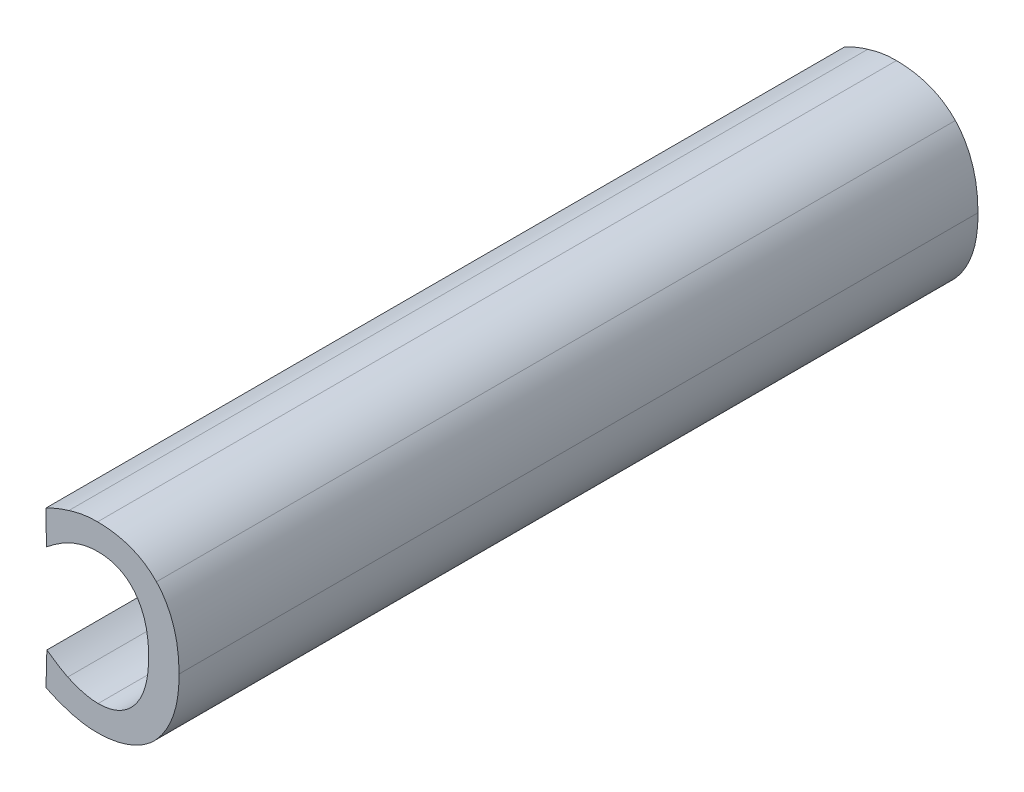
ISO-10303-21;
HEADER;
FILE_DESCRIPTION(('STEP AP214'),'2;1');
FILE_NAME('part.step','',(''),(''),'','','');
FILE_SCHEMA(('AUTOMOTIVE_DESIGN { 1 0 10303 214 1 1 1 1 }'));
ENDSEC;
DATA;
#1=APPLICATION_CONTEXT('core data for automotive mechanical design processes');
#2=APPLICATION_PROTOCOL_DEFINITION('international standard','automotive_design',2000,#1);
#3=PRODUCT_CONTEXT('',#1,'mechanical');
#4=PRODUCT('Part','Part','',(#3));
#5=PRODUCT_RELATED_PRODUCT_CATEGORY('part','',(#4));
#6=PRODUCT_DEFINITION_FORMATION('','',#4);
#7=PRODUCT_DEFINITION_CONTEXT('part definition',#1,'design');
#8=PRODUCT_DEFINITION('design','',#6,#7);
#9=PRODUCT_DEFINITION_SHAPE('','',#8);
#10=(LENGTH_UNIT() NAMED_UNIT(*) SI_UNIT(.MILLI.,.METRE.));
#11=(NAMED_UNIT(*) PLANE_ANGLE_UNIT() SI_UNIT($,.RADIAN.));
#12=(NAMED_UNIT(*) SI_UNIT($,.STERADIAN.) SOLID_ANGLE_UNIT());
#13=UNCERTAINTY_MEASURE_WITH_UNIT(LENGTH_MEASURE(1.E-05),#10,'distance_accuracy_value','');
#14=(GEOMETRIC_REPRESENTATION_CONTEXT(3) GLOBAL_UNCERTAINTY_ASSIGNED_CONTEXT((#13)) GLOBAL_UNIT_ASSIGNED_CONTEXT((#10,
#11,#12)) REPRESENTATION_CONTEXT('',''));
#15=CARTESIAN_POINT('',(0.,0.,0.));
#16=DIRECTION('',(0.,0.,1.));
#17=DIRECTION('',(1.,0.,0.));
#18=AXIS2_PLACEMENT_3D('',#15,#16,#17);
#19=CARTESIAN_POINT('',(5.06824131282,3.557182086195,0.));
#20=CARTESIAN_POINT('',(5.06824131282,3.557182086195,0.1));
#21=CARTESIAN_POINT('',(5.067366985334,3.557631065174,0.));
#22=CARTESIAN_POINT('',(5.067366985334,3.557631065174,0.1));
#23=CARTESIAN_POINT('',(5.066138200759,3.558481762187,0.));
#24=CARTESIAN_POINT('',(5.066138200759,3.558481762187,0.1));
#25=CARTESIAN_POINT('',(5.065736482725,3.558812588803,0.));
#26=CARTESIAN_POINT('',(5.065736482725,3.558812588803,0.1));
#27=CARTESIAN_POINT('',(5.06558209667783,3.55893973025352,0.));
#28=CARTESIAN_POINT('',(5.06558209667783,3.55893973025352,0.1));
#29=CARTESIAN_POINT('',(5.06542771063066,3.55906687170404,0.));
#30=CARTESIAN_POINT('',(5.06542771063066,3.55906687170404,0.1));
#31=B_SPLINE_SURFACE_WITH_KNOTS('',2,1,((#19,#20),(#21,#22),(#23,#24),(#25,#26),(#27,#28),(#29,
#30)),.UNSPECIFIED.,.F.,.F.,.F.,(3,1,2,3),(2,2),(-2.,-1.,0.,0.3843144546698),(0.,0.01),.UNSPECIFIED.);
#32=CARTESIAN_POINT('',(5.06824131282,3.557182086195,0.1));
#33=CARTESIAN_POINT('',(5.06780043462121,3.55740398369807,0.1));
#34=CARTESIAN_POINT('',(5.06737421617499,3.55764837154961,0.1));
#35=CARTESIAN_POINT('',(5.06651550629512,3.55820520815789,0.1));
#36=CARTESIAN_POINT('',(5.0660856601189,3.55852171515238,0.1));
#37=CARTESIAN_POINT('',(5.06567311895268,3.55886477073311,0.1));
#38=B_SPLINE_CURVE_WITH_KNOTS('',3,(#32,#33,#34,#35,#36,#37),.UNSPECIFIED.,.F.,.F.,(4,2,4),(0.,
0.00147393631916353,0.0030753418627236),.UNSPECIFIED.);
#39=CARTESIAN_POINT('',(5.06824131282,3.557182086195,0.1));
#40=VERTEX_POINT('',#39);
#41=CARTESIAN_POINT('',(5.0656301455985,3.558812588803,0.1));
#42=VERTEX_POINT('',#41);
#43=EDGE_CURVE('E296',#40,#42,#38,.T.);
#44=DIRECTION('',(0.,0.,1.));
#45=VECTOR('',#44,1.);
#46=CARTESIAN_POINT('',(5.06824131282,3.557182086195,0.05));
#47=LINE('',#46,#45);
#48=CARTESIAN_POINT('',(5.06824131282,3.557182086195,0.));
#49=VERTEX_POINT('',#48);
#50=EDGE_CURVE('E299',#49,#40,#47,.T.);
#51=CARTESIAN_POINT('',(5.06824131282,3.557182086195,0.));
#52=CARTESIAN_POINT('',(5.06789120548477,3.55735820568304,0.));
#53=CARTESIAN_POINT('',(5.06755021010831,3.55754865346355,0.));
#54=CARTESIAN_POINT('',(5.06667921381394,3.55808606868598,0.));
#55=CARTESIAN_POINT('',(5.06616414456795,3.55845651575151,0.));
#56=CARTESIAN_POINT('',(5.06567311895268,3.55886477073311,0.));
#57=B_SPLINE_CURVE_WITH_KNOTS('',3,(#51,#52,#53,#54,#55,#56),.UNSPECIFIED.,.F.,.F.,(4,2,4),(0.,
0.00117172259293521,0.00307507390276876),.UNSPECIFIED.);
#58=CARTESIAN_POINT('',(5.0656301455985,3.558812588803,0.));
#59=VERTEX_POINT('',#58);
#60=EDGE_CURVE('E112',#49,#59,#57,.T.);
#61=DIRECTION('',(0.,0.,1.));
#62=VECTOR('',#61,1.);
#63=CARTESIAN_POINT('',(5.065523808472,3.55898773230535,0.1));
#64=LINE('',#63,#62);
#65=EDGE_CURVE('E310',#42,#59,#64,.F.);
#66=ORIENTED_EDGE('',*,*,#43,.F.);
#67=ORIENTED_EDGE('',*,*,#50,.F.);
#68=ORIENTED_EDGE('',*,*,#60,.T.);
#69=ORIENTED_EDGE('',*,*,#65,.F.);
#70=EDGE_LOOP('',(#66,#67,#68,#69));
#71=FACE_BOUND('',#70,.T.);
#72=ADVANCED_FACE('F17',(#71),#31,.T.);
#73=CARTESIAN_POINT('',(5.065523808472,3.558812588803,0.));
#74=DIRECTION('',(-1.,0.,0.));
#75=DIRECTION('',(0.,0.,1.));
#76=AXIS2_PLACEMENT_3D('',#73,#74,#75);
#77=PLANE('',#76);
#78=DIRECTION('',(0.,-1.,0.));
#79=VECTOR('',#78,1.);
#80=CARTESIAN_POINT('',(5.065523808472,3.564459808101,0.1));
#81=LINE('',#80,#79);
#82=CARTESIAN_POINT('',(5.065523808472,3.5546772561,0.1));
#83=VERTEX_POINT('',#82);
#84=EDGE_CURVE('E298',#42,#83,#81,.T.);
#85=ORIENTED_EDGE('',*,*,#84,.F.);
#86=ORIENTED_EDGE('',*,*,#65,.T.);
#87=DIRECTION('',(0.,1.,0.));
#88=VECTOR('',#87,1.);
#89=CARTESIAN_POINT('',(5.065523808472,3.558812588803,0.));
#90=LINE('',#89,#88);
#91=CARTESIAN_POINT('',(5.065523808472,3.5546772561,0.));
#92=VERTEX_POINT('',#91);
#93=EDGE_CURVE('E151',#59,#92,#90,.F.);
#94=ORIENTED_EDGE('',*,*,#93,.T.);
#95=DIRECTION('',(0.,0.,-1.));
#96=VECTOR('',#95,1.);
#97=CARTESIAN_POINT('',(5.065523808472,3.5546772561,0.05));
#98=LINE('',#97,#96);
#99=EDGE_CURVE('E305',#83,#92,#98,.T.);
#100=ORIENTED_EDGE('',*,*,#99,.F.);
#101=EDGE_LOOP('',(#85,#86,#94,#100));
#102=FACE_BOUND('',#101,.T.);
#103=ADVANCED_FACE('F472',(#102),#77,.T.);
#104=CARTESIAN_POINT('',(5.065523808472,3.5546772561,0.));
#105=CARTESIAN_POINT('',(5.065523808472,3.5546772561,0.1));
#106=CARTESIAN_POINT('',(5.066823484465,3.554015602867,0.));
#107=CARTESIAN_POINT('',(5.066823484465,3.554015602867,0.1));
#108=CARTESIAN_POINT('',(5.070179011572,3.552999492546,0.));
#109=CARTESIAN_POINT('',(5.070179011572,3.552999492546,0.1));
#110=CARTESIAN_POINT('',(5.071974927489,3.552999492546,0.));
#111=CARTESIAN_POINT('',(5.071974927489,3.552999492546,0.1));
#112=B_SPLINE_SURFACE_WITH_KNOTS('',2,1,((#104,#105),(#106,#107),(#108,#109),(#110,#111)),
.UNSPECIFIED.,.F.,.F.,.F.,(3,1,3),(2,2),(-2.,-1.,0.),(0.,0.01),.UNSPECIFIED.);
#113=CARTESIAN_POINT('',(5.065523808472,3.5546772561,0.1));
#114=CARTESIAN_POINT('',(5.06606217268396,3.55441788380417,0.1));
#115=CARTESIAN_POINT('',(5.06661051495785,3.55417406817985,0.1));
#116=CARTESIAN_POINT('',(5.06772788318569,3.55374078208094,0.1));
#117=CARTESIAN_POINT('',(5.0682969088555,3.55355131086005,0.1));
#118=CARTESIAN_POINT('',(5.06945637927102,3.55324993876996,0.1));
#119=CARTESIAN_POINT('',(5.07004682376147,3.55313803697664,0.1));
#120=CARTESIAN_POINT('',(5.07108451179727,3.55302154495165,0.1));
#121=CARTESIAN_POINT('',(5.07152959494888,3.5529967776093,0.1));
#122=CARTESIAN_POINT('',(5.071974927489,3.552999492546,0.1));
#123=B_SPLINE_CURVE_WITH_KNOTS('',3,(#113,#114,#115,#116,#117,#118,#119,#120,#121,#122),
.UNSPECIFIED.,.F.,.F.,(4,2,2,2,4),(0.,0.00179596258772347,0.00359190051140843,
0.0053878170390403,0.00672257808529129),.UNSPECIFIED.);
#124=CARTESIAN_POINT('',(5.071974927489,3.552999492546,0.1));
#125=VERTEX_POINT('',#124);
#126=EDGE_CURVE('E276',#83,#125,#123,.T.);
#127=CARTESIAN_POINT('',(5.065523808472,3.5546772561,0.));
#128=CARTESIAN_POINT('',(5.06606217268396,3.55441788380417,0.));
#129=CARTESIAN_POINT('',(5.06661051495785,3.55417406817985,0.));
#130=CARTESIAN_POINT('',(5.06772788318569,3.55374078208094,0.));
#131=CARTESIAN_POINT('',(5.0682969088555,3.55355131086005,0.));
#132=CARTESIAN_POINT('',(5.06945637927102,3.55324993876996,0.));
#133=CARTESIAN_POINT('',(5.07004682376147,3.55313803697664,0.));
#134=CARTESIAN_POINT('',(5.07108451179727,3.55302154495165,0.));
#135=CARTESIAN_POINT('',(5.07152959494888,3.5529967776093,0.));
#136=CARTESIAN_POINT('',(5.071974927489,3.552999492546,0.));
#137=B_SPLINE_CURVE_WITH_KNOTS('',3,(#127,#128,#129,#130,#131,#132,#133,#134,#135,#136),
.UNSPECIFIED.,.F.,.F.,(4,2,2,2,4),(0.,0.00179596258772347,0.00359190051140843,
0.00538781703904115,0.00672257808529127),.UNSPECIFIED.);
#138=CARTESIAN_POINT('',(5.071974927489,3.552999492546,0.));
#139=VERTEX_POINT('',#138);
#140=EDGE_CURVE('E516',#92,#139,#137,.T.);
#141=DIRECTION('',(0.,0.,-1.));
#142=VECTOR('',#141,1.);
#143=CARTESIAN_POINT('',(5.071974927489,3.552999492546,0.05));
#144=LINE('',#143,#142);
#145=EDGE_CURVE('E309',#125,#139,#144,.T.);
#146=ORIENTED_EDGE('',*,*,#126,.F.);
#147=ORIENTED_EDGE('',*,*,#99,.T.);
#148=ORIENTED_EDGE('',*,*,#140,.T.);
#149=ORIENTED_EDGE('',*,*,#145,.F.);
#150=EDGE_LOOP('',(#146,#147,#148,#149));
#151=FACE_BOUND('',#150,.T.);
#152=ADVANCED_FACE('F463',(#151),#112,.T.);
#153=CARTESIAN_POINT('',(5.071974927489,3.552999492546,0.));
#154=CARTESIAN_POINT('',(5.071974927489,3.552999492546,0.1));
#155=CARTESIAN_POINT('',(5.074196191913,3.552999492546,0.));
#156=CARTESIAN_POINT('',(5.074196191913,3.552999492546,0.1));
#157=CARTESIAN_POINT('',(5.078047958945,3.554535473264,0.));
#158=CARTESIAN_POINT('',(5.078047958945,3.554535473264,0.1));
#159=CARTESIAN_POINT('',(5.079347634938,3.555976932092,0.));
#160=CARTESIAN_POINT('',(5.079347634938,3.555976932092,0.1));
#161=B_SPLINE_SURFACE_WITH_KNOTS('',2,1,((#153,#154),(#155,#156),(#157,#158),(#159,#160)),
.UNSPECIFIED.,.F.,.F.,.F.,(3,1,3),(2,2),(-2.,-1.,0.),(0.,0.01),.UNSPECIFIED.);
#162=CARTESIAN_POINT('',(5.071974927489,3.552999492546,0.1));
#163=CARTESIAN_POINT('',(5.07265669164065,3.55299818155809,0.0999999999999999));
#164=CARTESIAN_POINT('',(5.07333902325395,3.55305401451906,0.1));
#165=CARTESIAN_POINT('',(5.07434478438879,3.5532297996063,0.1));
#166=CARTESIAN_POINT('',(5.0746766846069,3.55330358680294,0.1));
#167=CARTESIAN_POINT('',(5.07533196034996,3.55348281331395,0.1));
#168=CARTESIAN_POINT('',(5.07565533522938,3.55358825501776,0.1));
#169=CARTESIAN_POINT('',(5.07629032157653,3.55383032352675,0.1));
#170=CARTESIAN_POINT('',(5.07660193126521,3.55396695502641,0.1));
#171=CARTESIAN_POINT('',(5.07720820408093,3.5542742836458,0.1));
#172=CARTESIAN_POINT('',(5.07750286169827,3.55444499176133,0.1));
#173=CARTESIAN_POINT('',(5.07807077821904,3.55482169799583,0.1));
#174=CARTESIAN_POINT('',(5.07834393101328,3.55502785684873,0.1));
#175=CARTESIAN_POINT('',(5.07886654439065,3.55547613716735,0.1));
#176=CARTESIAN_POINT('',(5.07911555689705,3.55571878041964,0.1));
#177=CARTESIAN_POINT('',(5.07934763492655,3.55597693207931,0.1));
#178=B_SPLINE_CURVE_WITH_KNOTS('',3,(#162,#163,#164,#165,#166,#167,#168,#169,#170,#171,#172,
#173,#174,#175,#176,#177),.UNSPECIFIED.,.F.,.F.,(4,2,2,2,2,2,2,4),(0.,0.00204239067197012,
0.00306108269162819,0.004079851626666,0.00509877400138055,0.00611802569397581,
0.00714202678322715,0.00818238265408445),.UNSPECIFIED.);
#179=CARTESIAN_POINT('',(5.079347634938,3.555976932092,0.1));
#180=VERTEX_POINT('',#179);
#181=EDGE_CURVE('E268',#125,#180,#178,.T.);
#182=CARTESIAN_POINT('',(5.071974927489,3.552999492546,0.));
#183=CARTESIAN_POINT('',(5.07265669164065,3.55299818155809,0.));
#184=CARTESIAN_POINT('',(5.07333902325395,3.55305401451906,0.));
#185=CARTESIAN_POINT('',(5.07434478438879,3.5532297996063,0.));
#186=CARTESIAN_POINT('',(5.0746766846069,3.55330358680294,0.));
#187=CARTESIAN_POINT('',(5.07533196034996,3.55348281331395,0.));
#188=CARTESIAN_POINT('',(5.07565533522938,3.55358825501776,0.));
#189=CARTESIAN_POINT('',(5.07629032157653,3.55383032352675,0.));
#190=CARTESIAN_POINT('',(5.07660193126521,3.55396695502641,0.));
#191=CARTESIAN_POINT('',(5.07720820408093,3.5542742836458,0.));
#192=CARTESIAN_POINT('',(5.07750286169827,3.55444499176133,0.));
#193=CARTESIAN_POINT('',(5.07807077821904,3.55482169799583,0.));
#194=CARTESIAN_POINT('',(5.07834393101328,3.55502785684873,0.));
#195=CARTESIAN_POINT('',(5.07886654439065,3.55547613716735,0.));
#196=CARTESIAN_POINT('',(5.07911555689705,3.55571878041964,0.));
#197=CARTESIAN_POINT('',(5.07934763492655,3.55597693207931,0.));
#198=B_SPLINE_CURVE_WITH_KNOTS('',3,(#182,#183,#184,#185,#186,#187,#188,#189,#190,#191,#192,
#193,#194,#195,#196,#197),.UNSPECIFIED.,.F.,.F.,(4,2,2,2,2,2,2,4),(0.,0.00204239067197012,
0.00306108269162819,0.004079851626666,0.00509877400138055,0.00611802569397581,
0.00714202678322715,0.00818238265408445),.UNSPECIFIED.);
#199=CARTESIAN_POINT('',(5.07934763493819,3.55597693209181,0.));
#200=VERTEX_POINT('',#199);
#201=EDGE_CURVE('E523',#139,#200,#198,.T.);
#202=DIRECTION('',(0.,0.,-1.));
#203=VECTOR('',#202,1.);
#204=CARTESIAN_POINT('',(5.079347634938,3.555976932092,0.05));
#205=LINE('',#204,#203);
#206=EDGE_CURVE('E313',#180,#200,#205,.T.);
#207=ORIENTED_EDGE('',*,*,#181,.F.);
#208=ORIENTED_EDGE('',*,*,#145,.T.);
#209=ORIENTED_EDGE('',*,*,#201,.T.);
#210=ORIENTED_EDGE('',*,*,#206,.F.);
#211=EDGE_LOOP('',(#207,#208,#209,#210));
#212=FACE_BOUND('',#211,.T.);
#213=ADVANCED_FACE('F454',(#212),#161,.T.);
#214=CARTESIAN_POINT('',(5.079347634938,3.555976932092,0.));
#215=CARTESIAN_POINT('',(5.079347634938,3.555976932092,0.1));
#216=CARTESIAN_POINT('',(5.08064731093,3.557394760448,0.));
#217=CARTESIAN_POINT('',(5.08064731093,3.557394760448,0.1));
#218=CARTESIAN_POINT('',(5.082183291649,3.561600984569,0.));
#219=CARTESIAN_POINT('',(5.082183291649,3.561600984569,0.1));
#220=CARTESIAN_POINT('',(5.082183291649,3.564483902225,0.));
#221=CARTESIAN_POINT('',(5.082183291649,3.564483902225,0.1));
#222=B_SPLINE_SURFACE_WITH_KNOTS('',2,1,((#214,#215),(#216,#217),(#218,#219),(#220,#221)),
.UNSPECIFIED.,.F.,.F.,.F.,(3,1,3),(2,2),(-2.,-1.,0.),(0.,0.01),.UNSPECIFIED.);
#223=CARTESIAN_POINT('',(5.079347634938,3.555976932092,0.1));
#224=CARTESIAN_POINT('',(5.07959212533499,3.55624349858091,0.1));
#225=CARTESIAN_POINT('',(5.07981936774911,3.55652521532284,0.1));
#226=CARTESIAN_POINT('',(5.0802400912057,3.55711277624557,0.1));
#227=CARTESIAN_POINT('',(5.08043358332241,3.55741861246423,0.1));
#228=CARTESIAN_POINT('',(5.0807876400347,3.55804831504722,0.1));
#229=CARTESIAN_POINT('',(5.08094821584625,3.55837217522205,0.1));
#230=CARTESIAN_POINT('',(5.08124154874952,3.55903216187993,0.1));
#231=CARTESIAN_POINT('',(5.08137431337673,3.55936828501125,0.1));
#232=CARTESIAN_POINT('',(5.08160610822409,3.56005216071821,0.1));
#233=CARTESIAN_POINT('',(5.08170512903172,3.56039991650902,0.1));
#234=CARTESIAN_POINT('',(5.08193244776284,3.56135660403018,0.1));
#235=CARTESIAN_POINT('',(5.08203015338335,3.56197258687727,0.1));
#236=CARTESIAN_POINT('',(5.08215551786839,3.56322135047994,0.1));
#237=CARTESIAN_POINT('',(5.08218211466357,3.56385424483962,0.1));
#238=CARTESIAN_POINT('',(5.082183291649,3.564483902225,0.1));
#239=B_SPLINE_CURVE_WITH_KNOTS('',3,(#223,#224,#225,#226,#227,#228,#229,#230,#231,#232,#233,
#234,#235,#236,#237,#238),.UNSPECIFIED.,.F.,.F.,(4,2,2,2,2,2,2,4),(0.,0.00108372170876831,
0.00216708715238745,0.00325008283182401,0.0043327846906132,0.0054157883120633,
0.00728179033563121,0.00917551089850671),.UNSPECIFIED.);
#240=CARTESIAN_POINT('',(5.082183291649,3.564483902225,0.1));
#241=VERTEX_POINT('',#240);
#242=EDGE_CURVE('E260',#180,#241,#239,.T.);
#243=CARTESIAN_POINT('',(5.079347634938,3.555976932092,0.));
#244=CARTESIAN_POINT('',(5.07959212533499,3.55624349858091,0.));
#245=CARTESIAN_POINT('',(5.07981936774911,3.55652521532284,0.));
#246=CARTESIAN_POINT('',(5.0802400912057,3.55711277624557,0.));
#247=CARTESIAN_POINT('',(5.08043358332241,3.55741861246423,0.));
#248=CARTESIAN_POINT('',(5.0807876400347,3.55804831504722,0.));
#249=CARTESIAN_POINT('',(5.08094821584625,3.55837217522205,0.));
#250=CARTESIAN_POINT('',(5.08124154874952,3.55903216187993,0.));
#251=CARTESIAN_POINT('',(5.08137431337673,3.55936828501125,0.));
#252=CARTESIAN_POINT('',(5.08160610822409,3.56005216071821,0.));
#253=CARTESIAN_POINT('',(5.08170512903172,3.56039991650902,0.));
#254=CARTESIAN_POINT('',(5.08193244776284,3.56135660403018,0.));
#255=CARTESIAN_POINT('',(5.08203015338335,3.56197258687727,0.));
#256=CARTESIAN_POINT('',(5.08215551786839,3.56322135047994,0.));
#257=CARTESIAN_POINT('',(5.08218211466357,3.56385424483962,0.));
#258=CARTESIAN_POINT('',(5.082183291649,3.564483902225,0.));
#259=B_SPLINE_CURVE_WITH_KNOTS('',3,(#243,#244,#245,#246,#247,#248,#249,#250,#251,#252,#253,
#254,#255,#256,#257,#258),.UNSPECIFIED.,.F.,.F.,(4,2,2,2,2,2,2,4),(0.,0.00108372170876831,
0.00216708715238745,0.00325008283182401,0.0043327846906132,0.0054157883120633,
0.00728179033563121,0.00917551089850671),.UNSPECIFIED.);
#260=CARTESIAN_POINT('',(5.082183291649,3.564483902225,0.));
#261=VERTEX_POINT('',#260);
#262=EDGE_CURVE('E539',#200,#261,#259,.T.);
#263=DIRECTION('',(0.,0.,-1.));
#264=VECTOR('',#263,1.);
#265=CARTESIAN_POINT('',(5.082183291649,3.564483902225,0.05));
#266=LINE('',#265,#264);
#267=EDGE_CURVE('E316',#241,#261,#266,.T.);
#268=ORIENTED_EDGE('',*,*,#242,.F.);
#269=ORIENTED_EDGE('',*,*,#206,.T.);
#270=ORIENTED_EDGE('',*,*,#262,.T.);
#271=ORIENTED_EDGE('',*,*,#267,.F.);
#272=EDGE_LOOP('',(#268,#269,#270,#271));
#273=FACE_BOUND('',#272,.T.);
#274=ADVANCED_FACE('F445',(#273),#222,.T.);
#275=CARTESIAN_POINT('',(5.082183291649,3.564483902225,0.));
#276=CARTESIAN_POINT('',(5.082183291649,3.564483902225,0.1));
#277=CARTESIAN_POINT('',(5.082183291649,3.567366819881,0.));
#278=CARTESIAN_POINT('',(5.082183291649,3.567366819881,0.1));
#279=CARTESIAN_POINT('',(5.080694571876,3.571667565893,0.));
#280=CARTESIAN_POINT('',(5.080694571876,3.571667565893,0.1));
#281=CARTESIAN_POINT('',(5.079347634938,3.573061763776,0.));
#282=CARTESIAN_POINT('',(5.079347634938,3.573061763776,0.1));
#283=B_SPLINE_SURFACE_WITH_KNOTS('',2,1,((#275,#276),(#277,#278),(#279,#280),(#281,#282)),
.UNSPECIFIED.,.F.,.F.,.F.,(3,1,3),(2,2),(-2.,-1.,0.),(0.,0.01),.UNSPECIFIED.);
#284=CARTESIAN_POINT('',(5.082183291649,3.564483902225,0.1));
#285=CARTESIAN_POINT('',(5.08218288226581,3.56518534481603,0.1));
#286=CARTESIAN_POINT('',(5.08215044917242,3.56588827789938,0.1));
#287=CARTESIAN_POINT('',(5.0820357563586,3.56693457580601,0.1));
#288=CARTESIAN_POINT('',(5.08198655125141,3.56728185353979,0.1));
#289=CARTESIAN_POINT('',(5.08186314077906,3.56797219998152,0.1));
#290=CARTESIAN_POINT('',(5.08178893062074,3.56831526786941,0.1));
#291=CARTESIAN_POINT('',(5.08161091763839,3.56899379418749,0.1));
#292=CARTESIAN_POINT('',(5.08150710750665,3.56932925071647,0.1));
#293=CARTESIAN_POINT('',(5.08127032670399,3.56998973257966,0.1));
#294=CARTESIAN_POINT('',(5.0811373556022,3.57031475775966,0.1));
#295=CARTESIAN_POINT('',(5.0808400028036,3.5709505109916,0.1));
#296=CARTESIAN_POINT('',(5.08067561017381,3.57126123402032,0.1));
#297=CARTESIAN_POINT('',(5.08016897462221,3.57210068494363,0.0999999999999999));
#298=CARTESIAN_POINT('',(5.07978915821397,3.57260661568784,0.0999999999999999));
#299=CARTESIAN_POINT('',(5.07934763493822,3.57306176377577,0.1));
#300=B_SPLINE_CURVE_WITH_KNOTS('',3,(#284,#285,#286,#287,#288,#289,#290,#291,#292,#293,#294,
#295,#296,#297,#298,#299),.UNSPECIFIED.,.F.,.F.,(4,2,2,2,2,2,2,4),(0.,0.00210493527299103,
0.00315655793463321,0.00420838229365346,0.00526046655445852,0.00631256636138775,
0.00736503291069561,0.00925316565929955),.UNSPECIFIED.);
#301=CARTESIAN_POINT('',(5.079347634938,3.573061763776,0.1));
#302=VERTEX_POINT('',#301);
#303=EDGE_CURVE('E252',#241,#302,#300,.T.);
#304=CARTESIAN_POINT('',(5.082183291649,3.564483902225,0.));
#305=CARTESIAN_POINT('',(5.08218288226581,3.56518534481603,0.));
#306=CARTESIAN_POINT('',(5.08215044917242,3.56588827789938,0.));
#307=CARTESIAN_POINT('',(5.0820357563586,3.56693457580601,0.));
#308=CARTESIAN_POINT('',(5.08198655125141,3.56728185353979,0.));
#309=CARTESIAN_POINT('',(5.08186314077906,3.56797219998152,0.));
#310=CARTESIAN_POINT('',(5.08178893062074,3.56831526786941,0.));
#311=CARTESIAN_POINT('',(5.08161091763839,3.56899379418749,0.));
#312=CARTESIAN_POINT('',(5.08150710750665,3.56932925071647,0.));
#313=CARTESIAN_POINT('',(5.08127032670399,3.56998973257966,0.));
#314=CARTESIAN_POINT('',(5.0811373556022,3.57031475775966,0.));
#315=CARTESIAN_POINT('',(5.0808400028036,3.5709505109916,0.));
#316=CARTESIAN_POINT('',(5.08067561017381,3.57126123402032,0.));
#317=CARTESIAN_POINT('',(5.08016897462221,3.57210068494363,0.));
#318=CARTESIAN_POINT('',(5.07978915821397,3.57260661568784,0.));
#319=CARTESIAN_POINT('',(5.07934763493822,3.57306176377577,0.));
#320=B_SPLINE_CURVE_WITH_KNOTS('',3,(#304,#305,#306,#307,#308,#309,#310,#311,#312,#313,#314,
#315,#316,#317,#318,#319),.UNSPECIFIED.,.F.,.F.,(4,2,2,2,2,2,2,4),(0.,0.00210493527299103,
0.00315655793463321,0.00420838229365346,0.00526046655445852,0.00631256636138775,
0.00736503291069561,0.00925316565929955),.UNSPECIFIED.);
#321=CARTESIAN_POINT('',(5.079347634938,3.573061763776,0.));
#322=VERTEX_POINT('',#321);
#323=EDGE_CURVE('E540',#261,#322,#320,.T.);
#324=DIRECTION('',(0.,0.,-1.));
#325=VECTOR('',#324,1.);
#326=CARTESIAN_POINT('',(5.079347634938,3.573061763776,0.05));
#327=LINE('',#326,#325);
#328=EDGE_CURVE('E319',#302,#322,#327,.T.);
#329=ORIENTED_EDGE('',*,*,#303,.F.);
#330=ORIENTED_EDGE('',*,*,#267,.T.);
#331=ORIENTED_EDGE('',*,*,#323,.T.);
#332=ORIENTED_EDGE('',*,*,#328,.F.);
#333=EDGE_LOOP('',(#329,#330,#331,#332));
#334=FACE_BOUND('',#333,.T.);
#335=ADVANCED_FACE('F436',(#334),#283,.T.);
#336=CARTESIAN_POINT('',(5.079347634938,3.573061763776,0.));
#337=CARTESIAN_POINT('',(5.079347634938,3.573061763776,0.1));
#338=CARTESIAN_POINT('',(5.078000698,3.574479592131,0.));
#339=CARTESIAN_POINT('',(5.078000698,3.574479592131,0.1));
#340=CARTESIAN_POINT('',(5.074243452858,3.575873790014,0.));
#341=CARTESIAN_POINT('',(5.074243452858,3.575873790014,0.1));
#342=CARTESIAN_POINT('',(5.071974927489,3.575873790014,0.));
#343=CARTESIAN_POINT('',(5.071974927489,3.575873790014,0.1));
#344=B_SPLINE_SURFACE_WITH_KNOTS('',2,1,((#336,#337),(#338,#339),(#340,#341),(#342,#343)),
.UNSPECIFIED.,.F.,.F.,.F.,(3,1,3),(2,2),(-2.,-1.,0.),(0.,0.01),.UNSPECIFIED.);
#345=CARTESIAN_POINT('',(5.079347634938,3.573061763776,0.1));
#346=CARTESIAN_POINT('',(5.07910869469614,3.57331403607231,0.1));
#347=CARTESIAN_POINT('',(5.0788538842339,3.57355125944491,0.1));
#348=CARTESIAN_POINT('',(5.07831673402064,3.57399223219477,0.1));
#349=CARTESIAN_POINT('',(5.07803439138775,3.57419597806186,0.1));
#350=CARTESIAN_POINT('',(5.07744646219324,3.57456655126743,0.1));
#351=CARTESIAN_POINT('',(5.07714087740096,3.57473338141239,0.1));
#352=CARTESIAN_POINT('',(5.07651213652177,3.57502900617745,0.1));
#353=CARTESIAN_POINT('',(5.07618898475907,3.57515781010816,0.1));
#354=CARTESIAN_POINT('',(5.07553155202705,3.57538181084551,0.1));
#355=CARTESIAN_POINT('',(5.0751972759386,3.57547702218375,0.1));
#356=CARTESIAN_POINT('',(5.07452146039062,3.57563552310427,0.1));
#357=CARTESIAN_POINT('',(5.07417992220921,3.57569881825604,0.1));
#358=CARTESIAN_POINT('',(5.07322007462478,3.5758344542964,0.1));
#359=CARTESIAN_POINT('',(5.0725968762342,3.57587422929771,0.1));
#360=CARTESIAN_POINT('',(5.071974927489,3.575873790014,0.1));
#361=B_SPLINE_CURVE_WITH_KNOTS('',3,(#345,#346,#347,#348,#349,#350,#351,#352,#353,#354,#355,
#356,#357,#358,#359,#360),.UNSPECIFIED.,.F.,.F.,(4,2,2,2,2,2,2,4),(0.,0.00104171843109211,
0.00208354601827699,0.00312529437434095,0.00416678744946911,0.00520782943725792,
0.00624868969650959,0.00811422320780603),.UNSPECIFIED.);
#362=CARTESIAN_POINT('',(5.071974927489,3.575873790014,0.1));
#363=VERTEX_POINT('',#362);
#364=EDGE_CURVE('E244',#302,#363,#361,.T.);
#365=CARTESIAN_POINT('',(5.079347634938,3.573061763776,0.));
#366=CARTESIAN_POINT('',(5.07910869469614,3.57331403607231,0.));
#367=CARTESIAN_POINT('',(5.0788538842339,3.57355125944491,0.));
#368=CARTESIAN_POINT('',(5.07831673402064,3.57399223219477,0.));
#369=CARTESIAN_POINT('',(5.07803439138775,3.57419597806186,0.));
#370=CARTESIAN_POINT('',(5.07744646219324,3.57456655126743,0.));
#371=CARTESIAN_POINT('',(5.07714087740096,3.57473338141239,0.));
#372=CARTESIAN_POINT('',(5.07651213652177,3.57502900617745,0.));
#373=CARTESIAN_POINT('',(5.07618898475907,3.57515781010816,0.));
#374=CARTESIAN_POINT('',(5.07553155202705,3.57538181084551,0.));
#375=CARTESIAN_POINT('',(5.0751972759386,3.57547702218375,0.));
#376=CARTESIAN_POINT('',(5.07452146039062,3.57563552310427,0.));
#377=CARTESIAN_POINT('',(5.07417992220921,3.57569881825604,0.));
#378=CARTESIAN_POINT('',(5.07322007462478,3.5758344542964,0.));
#379=CARTESIAN_POINT('',(5.0725968762342,3.57587422929771,0.));
#380=CARTESIAN_POINT('',(5.071974927489,3.575873790014,0.));
#381=B_SPLINE_CURVE_WITH_KNOTS('',3,(#365,#366,#367,#368,#369,#370,#371,#372,#373,#374,#375,
#376,#377,#378,#379,#380),.UNSPECIFIED.,.F.,.F.,(4,2,2,2,2,2,2,4),(0.,0.00104171843109211,
0.00208354601827699,0.00312529437434095,0.00416678744946911,0.00520782943725792,
0.00624868969650959,0.00811422320780603),.UNSPECIFIED.);
#382=CARTESIAN_POINT('',(5.071974927489,3.575873790014,0.));
#383=VERTEX_POINT('',#382);
#384=EDGE_CURVE('E541',#322,#383,#381,.T.);
#385=DIRECTION('',(0.,0.,-1.));
#386=VECTOR('',#385,1.);
#387=CARTESIAN_POINT('',(5.071974927489,3.575873790014,0.05));
#388=LINE('',#387,#386);
#389=EDGE_CURVE('E322',#363,#383,#388,.T.);
#390=ORIENTED_EDGE('',*,*,#364,.F.);
#391=ORIENTED_EDGE('',*,*,#328,.T.);
#392=ORIENTED_EDGE('',*,*,#384,.T.);
#393=ORIENTED_EDGE('',*,*,#389,.F.);
#394=EDGE_LOOP('',(#390,#391,#392,#393));
#395=FACE_BOUND('',#394,.T.);
#396=ADVANCED_FACE('F427',(#395),#344,.T.);
#397=CARTESIAN_POINT('',(5.071974927489,3.575873790014,0.));
#398=CARTESIAN_POINT('',(5.071974927489,3.575873790014,0.1));
#399=CARTESIAN_POINT('',(5.070817034332,3.575873790014,0.));
#400=CARTESIAN_POINT('',(5.070817034332,3.575873790014,0.1));
#401=CARTESIAN_POINT('',(5.069328314559,3.575590224343,0.));
#402=CARTESIAN_POINT('',(5.069328314559,3.575590224343,0.1));
#403=CARTESIAN_POINT('',(5.068383095656,3.575306658672,0.));
#404=CARTESIAN_POINT('',(5.068383095656,3.575306658672,0.1));
#405=B_SPLINE_SURFACE_WITH_KNOTS('',2,1,((#397,#398),(#399,#400),(#401,#402),(#403,#404)),
.UNSPECIFIED.,.F.,.F.,.F.,(3,1,3),(2,2),(-2.,-1.,0.),(0.,0.01),.UNSPECIFIED.);
#406=CARTESIAN_POINT('',(5.071974927489,3.575873790014,0.1));
#407=CARTESIAN_POINT('',(5.07158779694213,3.57588644214074,0.1));
#408=CARTESIAN_POINT('',(5.07120168725108,3.57586997537106,0.1));
#409=CARTESIAN_POINT('',(5.07033841020425,3.57578048445803,0.1));
#410=CARTESIAN_POINT('',(5.06986252794467,3.57569438928755,0.1));
#411=CARTESIAN_POINT('',(5.06905268129334,3.57550273561911,0.1));
#412=CARTESIAN_POINT('',(5.06871583213535,3.57540912609632,0.1));
#413=CARTESIAN_POINT('',(5.068383095656,3.575306658672,0.1));
#414=B_SPLINE_CURVE_WITH_KNOTS('',3,(#406,#407,#408,#409,#410,#411,#412,#413),.UNSPECIFIED.,.F.,
.F.,(4,2,2,4),(0.,0.00115787833771771,0.00260428861916251,0.00365108579594424),.UNSPECIFIED.);
#415=CARTESIAN_POINT('',(5.068383095656,3.575306658672,0.1));
#416=VERTEX_POINT('',#415);
#417=EDGE_CURVE('E214',#363,#416,#414,.T.);
#418=CARTESIAN_POINT('',(5.071974927489,3.575873790014,0.));
#419=CARTESIAN_POINT('',(5.07158779694213,3.57588644214074,0.));
#420=CARTESIAN_POINT('',(5.07120168725108,3.57586997537106,0.));
#421=CARTESIAN_POINT('',(5.07033841020425,3.57578048445803,0.));
#422=CARTESIAN_POINT('',(5.06986252794467,3.57569438928755,0.));
#423=CARTESIAN_POINT('',(5.06905268129334,3.57550273561911,0.));
#424=CARTESIAN_POINT('',(5.06871583213535,3.57540912609632,0.));
#425=CARTESIAN_POINT('',(5.068383095656,3.575306658672,0.));
#426=B_SPLINE_CURVE_WITH_KNOTS('',3,(#418,#419,#420,#421,#422,#423,#424,#425),.UNSPECIFIED.,.F.,
.F.,(4,2,2,4),(0.,0.00115787833771771,0.00260428861916251,0.00365108579594424),.UNSPECIFIED.);
#427=CARTESIAN_POINT('',(5.068383095656,3.575306658672,0.));
#428=VERTEX_POINT('',#427);
#429=EDGE_CURVE('E587',#383,#428,#426,.T.);
#430=DIRECTION('',(0.,0.,-1.));
#431=VECTOR('',#430,1.);
#432=CARTESIAN_POINT('',(5.068383095656,3.575306658672,0.05));
#433=LINE('',#432,#431);
#434=EDGE_CURVE('E325',#416,#428,#433,.T.);
#435=ORIENTED_EDGE('',*,*,#417,.F.);
#436=ORIENTED_EDGE('',*,*,#389,.T.);
#437=ORIENTED_EDGE('',*,*,#429,.T.);
#438=ORIENTED_EDGE('',*,*,#434,.F.);
#439=EDGE_LOOP('',(#435,#436,#437,#438));
#440=FACE_BOUND('',#439,.T.);
#441=ADVANCED_FACE('F418',(#440),#405,.T.);
#442=CARTESIAN_POINT('',(5.068383095656,3.575306658672,0.));
#443=CARTESIAN_POINT('',(5.068383095656,3.575306658672,0.1));
#444=CARTESIAN_POINT('',(5.067721442423,3.575141245364,0.));
#445=CARTESIAN_POINT('',(5.067721442423,3.575141245364,0.1));
#446=CARTESIAN_POINT('',(5.066067309342,3.574408700714,0.));
#447=CARTESIAN_POINT('',(5.066067309342,3.574408700714,0.1));
#448=CARTESIAN_POINT('',(5.065523808472,3.574148765515,0.));
#449=CARTESIAN_POINT('',(5.065523808472,3.574148765515,0.1));
#450=B_SPLINE_SURFACE_WITH_KNOTS('',2,1,((#442,#443),(#444,#445),(#446,#447),(#448,#449)),
.UNSPECIFIED.,.F.,.F.,.F.,(3,1,3),(2,2),(-2.,-1.,0.),(0.,0.01),.UNSPECIFIED.);
#451=CARTESIAN_POINT('',(5.068383095656,3.575306658672,0.1));
#452=CARTESIAN_POINT('',(5.06794886134684,3.57517655927386,0.1));
#453=CARTESIAN_POINT('',(5.06752151768047,3.57502916068925,0.1));
#454=CARTESIAN_POINT('',(5.06656407275335,3.57465411511554,0.1));
#455=CARTESIAN_POINT('',(5.06603832069299,3.5744155493151,0.1));
#456=CARTESIAN_POINT('',(5.06552380847583,3.57414876551683,0.1));
#457=B_SPLINE_CURVE_WITH_KNOTS('',3,(#451,#452,#453,#454,#455,#456),.UNSPECIFIED.,.F.,.F.,(4,2,
4),(0.,0.00135614916855325,0.0030881883802871),.UNSPECIFIED.);
#458=CARTESIAN_POINT('',(5.065523808472,3.574148765515,0.1));
#459=VERTEX_POINT('',#458);
#460=EDGE_CURVE('E238',#416,#459,#457,.T.);
#461=CARTESIAN_POINT('',(5.068383095656,3.575306658672,0.));
#462=CARTESIAN_POINT('',(5.06794886134684,3.57517655927386,0.));
#463=CARTESIAN_POINT('',(5.06752151768047,3.57502916068925,0.));
#464=CARTESIAN_POINT('',(5.06656407275335,3.57465411511554,0.));
#465=CARTESIAN_POINT('',(5.06603832069299,3.5744155493151,0.));
#466=CARTESIAN_POINT('',(5.06552380847583,3.57414876551683,0.));
#467=B_SPLINE_CURVE_WITH_KNOTS('',3,(#461,#462,#463,#464,#465,#466),.UNSPECIFIED.,.F.,.F.,(4,2,
4),(0.,0.00135614916855325,0.0030881883802871),.UNSPECIFIED.);
#468=CARTESIAN_POINT('',(5.06552380847392,3.57414876551592,0.));
#469=VERTEX_POINT('',#468);
#470=EDGE_CURVE('E144',#428,#469,#467,.T.);
#471=DIRECTION('',(0.,0.,1.));
#472=VECTOR('',#471,1.);
#473=CARTESIAN_POINT('',(5.065523808472,3.574148765515,0.));
#474=LINE('',#473,#472);
#475=EDGE_CURVE('E136',#459,#469,#474,.F.);
#476=ORIENTED_EDGE('',*,*,#460,.F.);
#477=ORIENTED_EDGE('',*,*,#434,.T.);
#478=ORIENTED_EDGE('',*,*,#470,.T.);
#479=ORIENTED_EDGE('',*,*,#475,.F.);
#480=EDGE_LOOP('',(#476,#477,#478,#479));
#481=FACE_BOUND('',#480,.T.);
#482=ADVANCED_FACE('F178',(#481),#450,.T.);
#483=CARTESIAN_POINT('',(5.065523808472,3.574148765515,0.));
#484=DIRECTION('',(-1.,0.,0.));
#485=DIRECTION('',(0.,0.,1.));
#486=AXIS2_PLACEMENT_3D('',#483,#484,#485);
#487=PLANE('',#486);
#488=DIRECTION('',(0.,1.,0.));
#489=VECTOR('',#488,1.);
#490=CARTESIAN_POINT('',(5.065523808472,3.564459808101,0.1));
#491=LINE('',#490,#489);
#492=CARTESIAN_POINT('',(5.06557281335503,3.56996042753033,0.1));
#493=VERTEX_POINT('',#492);
#494=EDGE_CURVE('E329',#459,#493,#491,.F.);
#495=ORIENTED_EDGE('',*,*,#494,.F.);
#496=ORIENTED_EDGE('',*,*,#475,.T.);
#497=DIRECTION('',(0.,1.,0.));
#498=VECTOR('',#497,1.);
#499=CARTESIAN_POINT('',(5.065523808472,3.564459808101,0.));
#500=LINE('',#499,#498);
#501=CARTESIAN_POINT('',(5.06557281335503,3.56996042753033,0.));
#502=VERTEX_POINT('',#501);
#503=EDGE_CURVE('E140',#469,#502,#500,.F.);
#504=ORIENTED_EDGE('',*,*,#503,.T.);
#505=DIRECTION('',(0.,0.,1.));
#506=VECTOR('',#505,1.);
#507=CARTESIAN_POINT('',(5.065523808472,3.56981680944612,0.1));
#508=LINE('',#507,#506);
#509=EDGE_CURVE('E120',#493,#502,#508,.F.);
#510=ORIENTED_EDGE('',*,*,#509,.F.);
#511=EDGE_LOOP('',(#495,#496,#504,#510));
#512=FACE_BOUND('',#511,.T.);
#513=ADVANCED_FACE('F141',(#512),#487,.T.);
#514=CARTESIAN_POINT('',(5.06544277389762,3.56974189068871,0.));
#515=CARTESIAN_POINT('',(5.06544277389762,3.56974189068871,0.1));
#516=CARTESIAN_POINT('',(5.06558962831131,3.56987766175036,0.));
#517=CARTESIAN_POINT('',(5.06558962831131,3.56987766175036,0.1));
#518=CARTESIAN_POINT('',(5.065736482725,3.570013432812,0.));
#519=CARTESIAN_POINT('',(5.065736482725,3.570013432812,0.1));
#520=CARTESIAN_POINT('',(5.066988897773,3.571171325969,0.));
#521=CARTESIAN_POINT('',(5.066988897773,3.571171325969,0.1));
#522=CARTESIAN_POINT('',(5.07024990299,3.572660045742,0.));
#523=CARTESIAN_POINT('',(5.07024990299,3.572660045742,0.1));
#524=CARTESIAN_POINT('',(5.072045818907,3.572660045742,0.));
#525=CARTESIAN_POINT('',(5.072045818907,3.572660045742,0.1));
#526=B_SPLINE_SURFACE_WITH_KNOTS('',2,1,((#514,#515),(#516,#517),(#518,#519),(#520,#521),(#522,
#523),(#524,#525)),.UNSPECIFIED.,.F.,.F.,.F.,(3,2,1,3),(2,2),(-2.11725698595189,-2.,-1.,0.),(0.,
0.01),.UNSPECIFIED.);
#527=CARTESIAN_POINT('',(5.06562181823806,3.56990742224866,0.1));
#528=CARTESIAN_POINT('',(5.06596740099712,3.57023416688717,0.1));
#529=CARTESIAN_POINT('',(5.06633434553466,3.57053831153456,0.1));
#530=CARTESIAN_POINT('',(5.06723366948291,3.57118877171079,0.1));
#531=CARTESIAN_POINT('',(5.0677804129621,3.57151533155056,0.1));
#532=CARTESIAN_POINT('',(5.06892567640419,3.57206487409843,0.1));
#533=CARTESIAN_POINT('',(5.06952418585406,3.57228787777916,0.1));
#534=CARTESIAN_POINT('',(5.07076087399376,3.57259251477264,0.1));
#535=CARTESIAN_POINT('',(5.07139937594434,3.57267278278688,0.1));
#536=CARTESIAN_POINT('',(5.072045818907,3.572660045742,0.1));
#537=B_SPLINE_CURVE_WITH_KNOTS('',3,(#527,#528,#529,#530,#531,#532,#533,#534,#535,#536),
.UNSPECIFIED.,.F.,.F.,(4,2,2,2,4),(0.,0.00142580080026873,0.00332703540922765,
0.00522788480369459,0.00714682038544398),.UNSPECIFIED.);
#538=CARTESIAN_POINT('',(5.072045818907,3.572660045742,0.1));
#539=VERTEX_POINT('',#538);
#540=EDGE_CURVE('E134',#493,#539,#537,.T.);
#541=CARTESIAN_POINT('',(5.06562181823806,3.56990742224866,0.));
#542=CARTESIAN_POINT('',(5.06596740099712,3.57023416688717,0.));
#543=CARTESIAN_POINT('',(5.06633434553466,3.57053831153456,0.));
#544=CARTESIAN_POINT('',(5.06723366948291,3.57118877171078,0.));
#545=CARTESIAN_POINT('',(5.0677804129621,3.57151533155056,0.));
#546=CARTESIAN_POINT('',(5.06892567640419,3.57206487409843,0.));
#547=CARTESIAN_POINT('',(5.06952418585406,3.57228787777916,0.));
#548=CARTESIAN_POINT('',(5.07076087399376,3.57259251477264,0.));
#549=CARTESIAN_POINT('',(5.07139937594434,3.57267278278688,0.));
#550=CARTESIAN_POINT('',(5.072045818907,3.572660045742,0.));
#551=B_SPLINE_CURVE_WITH_KNOTS('',3,(#541,#542,#543,#544,#545,#546,#547,#548,#549,#550),
.UNSPECIFIED.,.F.,.F.,(4,2,2,2,4),(0.,0.00142580080026751,0.00332703540922472,
0.0052278848036918,0.00714682038544474),.UNSPECIFIED.);
#552=CARTESIAN_POINT('',(5.072045818907,3.572660045742,0.));
#553=VERTEX_POINT('',#552);
#554=EDGE_CURVE('E132',#502,#553,#551,.T.);
#555=DIRECTION('',(0.,0.,-1.));
#556=VECTOR('',#555,1.);
#557=CARTESIAN_POINT('',(5.072045818907,3.572660045742,0.05));
#558=LINE('',#557,#556);
#559=EDGE_CURVE('E333',#539,#553,#558,.T.);
#560=ORIENTED_EDGE('',*,*,#540,.F.);
#561=ORIENTED_EDGE('',*,*,#509,.T.);
#562=ORIENTED_EDGE('',*,*,#554,.T.);
#563=ORIENTED_EDGE('',*,*,#559,.F.);
#564=EDGE_LOOP('',(#560,#561,#562,#563));
#565=FACE_BOUND('',#564,.T.);
#566=ADVANCED_FACE('F129',(#565),#526,.T.);
#567=CARTESIAN_POINT('',(5.073765536832,3.564459808101,0.));
#568=DIRECTION('',(0.,0.,1.));
#569=DIRECTION('',(1.,0.,0.));
#570=AXIS2_PLACEMENT_3D('',#567,#568,#569);
#571=PLANE('',#570);
#572=ORIENTED_EDGE('',*,*,#470,.F.);
#573=ORIENTED_EDGE('',*,*,#429,.F.);
#574=ORIENTED_EDGE('',*,*,#384,.F.);
#575=ORIENTED_EDGE('',*,*,#323,.F.);
#576=ORIENTED_EDGE('',*,*,#262,.F.);
#577=ORIENTED_EDGE('',*,*,#201,.F.);
#578=ORIENTED_EDGE('',*,*,#140,.F.);
#579=ORIENTED_EDGE('',*,*,#93,.F.);
#580=ORIENTED_EDGE('',*,*,#60,.F.);
#581=CARTESIAN_POINT('',(5.072045818907,3.556213236818,0.));
#582=CARTESIAN_POINT('',(5.0716832494754,3.55621262957255,0.));
#583=CARTESIAN_POINT('',(5.0713239315613,3.55624535485484,0.));
#584=CARTESIAN_POINT('',(5.07061351393064,3.55636269011137,0.));
#585=CARTESIAN_POINT('',(5.07026241417041,3.55644729980984,0.));
#586=CARTESIAN_POINT('',(5.06934304337098,3.55672130890653,0.));
#587=CARTESIAN_POINT('',(5.06878342428643,3.55694303909782,0.));
#588=CARTESIAN_POINT('',(5.06824131282025,3.55718208619488,0.));
#589=B_SPLINE_CURVE_WITH_KNOTS('',3,(#581,#582,#583,#584,#585,#586,#587,#588),.UNSPECIFIED.,.F.,
.F.,(4,2,2,4),(0.,0.00108091638846154,0.00216182703201098,0.00395192801575711),.UNSPECIFIED.);
#590=CARTESIAN_POINT('',(5.072045818907,3.556213236818,0.));
#591=VERTEX_POINT('',#590);
#592=EDGE_CURVE('E143',#591,#49,#589,.T.);
#593=ORIENTED_EDGE('',*,*,#592,.F.);
#594=CARTESIAN_POINT('',(5.078378785562,3.564483902225,0.));
#595=CARTESIAN_POINT('',(5.07837518190356,3.5638583825199,0.));
#596=CARTESIAN_POINT('',(5.07834489639526,3.56322917435484,0.));
#597=CARTESIAN_POINT('',(5.07819629862371,3.56202170115026,0.));
#598=CARTESIAN_POINT('',(5.07808353661601,3.56144268932704,0.));
#599=CARTESIAN_POINT('',(5.07766005034559,3.56003328707638,0.));
#600=CARTESIAN_POINT('',(5.07727912716627,3.55921973287924,0.));
#601=CARTESIAN_POINT('',(5.07636694421304,3.55800290215938,0.));
#602=CARTESIAN_POINT('',(5.07590668712746,3.55754841674661,0.));
#603=CARTESIAN_POINT('',(5.0748883664094,3.556852338285,0.));
#604=CARTESIAN_POINT('',(5.07433817390218,3.5565992547098,0.));
#605=CARTESIAN_POINT('',(5.07320451314163,3.55627600601702,0.));
#606=CARTESIAN_POINT('',(5.07262258003967,3.55620047623328,0.));
#607=CARTESIAN_POINT('',(5.072045818907,3.556213236818,0.));
#608=B_SPLINE_CURVE_WITH_KNOTS('',3,(#594,#595,#596,#597,#598,#599,#600,#601,#602,#603,#604,
#605,#606,#607),.UNSPECIFIED.,.F.,.F.,(4,2,2,2,2,2,4),(0.,0.00188094742313775,
0.00364576432100963,0.00628084378567768,0.00818504700718622,0.00997072410227765,
0.0117017132031126),.UNSPECIFIED.);
#609=CARTESIAN_POINT('',(5.078378785562,3.564483902225,0.));
#610=VERTEX_POINT('',#609);
#611=EDGE_CURVE('E334',#610,#591,#608,.T.);
#612=ORIENTED_EDGE('',*,*,#611,.F.);
#613=CARTESIAN_POINT('',(5.072045818907,3.572660045742,0.));
#614=CARTESIAN_POINT('',(5.07274870457043,3.57268099075668,0.));
#615=CARTESIAN_POINT('',(5.0734633615224,3.57257341244542,0.));
#616=CARTESIAN_POINT('',(5.07469677283705,3.57215058544368,0.));
#617=CARTESIAN_POINT('',(5.07522851696861,3.57187174105602,0.));
#618=CARTESIAN_POINT('',(5.07621152198076,3.57111348334348,0.));
#619=CARTESIAN_POINT('',(5.07664965236254,3.57061698501128,0.));
#620=CARTESIAN_POINT('',(5.07740200766372,3.56946157265222,0.));
#621=CARTESIAN_POINT('',(5.07769621181752,3.56879055187537,0.));
#622=CARTESIAN_POINT('',(5.07802783493965,3.56769447273196,0.));
#623=CARTESIAN_POINT('',(5.07812119407709,3.56728409831745,0.));
#624=CARTESIAN_POINT('',(5.07832478403008,3.56608237876803,0.));
#625=CARTESIAN_POINT('',(5.07837486454094,3.56527988701542,0.));
#626=CARTESIAN_POINT('',(5.078378785562,3.564483902225,0.));
#627=B_SPLINE_CURVE_WITH_KNOTS('',3,(#613,#614,#615,#616,#617,#618,#619,#620,#621,#622,#623,
#624,#625,#626),.UNSPECIFIED.,.F.,.F.,(4,2,2,2,2,2,4),(0.,0.00211237947034365,
0.00388308991683423,0.00582863359810329,0.00799771874368007,0.00925838851102719,
0.011651272555913),.UNSPECIFIED.);
#628=EDGE_CURVE('E148',#553,#610,#627,.T.);
#629=ORIENTED_EDGE('',*,*,#628,.F.);
#630=ORIENTED_EDGE('',*,*,#554,.F.);
#631=ORIENTED_EDGE('',*,*,#503,.F.);
#632=EDGE_LOOP('',(#572,#573,#574,#575,#576,#577,#578,#579,#580,#593,#612,#629,#630,#631));
#633=FACE_BOUND('',#632,.T.);
#634=ADVANCED_FACE('F146',(#633),#571,.F.);
#635=CARTESIAN_POINT('',(5.072045818907,3.556213236818,0.));
#636=CARTESIAN_POINT('',(5.072045818907,3.556213236818,0.1));
#637=CARTESIAN_POINT('',(5.071100600004,3.556213236818,0.));
#638=CARTESIAN_POINT('',(5.071100600004,3.556213236818,0.1));
#639=CARTESIAN_POINT('',(5.069021118416,3.556803998633,0.));
#640=CARTESIAN_POINT('',(5.069021118416,3.556803998633,0.1));
#641=CARTESIAN_POINT('',(5.06824131282,3.557182086195,0.));
#642=CARTESIAN_POINT('',(5.06824131282,3.557182086195,0.1));
#643=B_SPLINE_SURFACE_WITH_KNOTS('',2,1,((#635,#636),(#637,#638),(#639,#640),(#641,#642)),
.UNSPECIFIED.,.F.,.F.,.F.,(3,1,3),(2,2),(-2.,-1.,0.),(0.,0.01),.UNSPECIFIED.);
#644=CARTESIAN_POINT('',(5.072045818907,3.556213236818,0.1));
#645=CARTESIAN_POINT('',(5.0716832494754,3.55621262957255,0.1));
#646=CARTESIAN_POINT('',(5.0713239315613,3.55624535485484,0.1));
#647=CARTESIAN_POINT('',(5.07061351393064,3.55636269011137,0.1));
#648=CARTESIAN_POINT('',(5.07026241417041,3.55644729980984,0.1));
#649=CARTESIAN_POINT('',(5.06934304337098,3.55672130890653,0.1));
#650=CARTESIAN_POINT('',(5.06878342428643,3.55694303909782,0.1));
#651=CARTESIAN_POINT('',(5.06824131282025,3.55718208619488,0.1));
#652=B_SPLINE_CURVE_WITH_KNOTS('',3,(#644,#645,#646,#647,#648,#649,#650,#651),.UNSPECIFIED.,.F.,
.F.,(4,2,2,4),(0.,0.00108091638846154,0.00216182703201098,0.00395192801575741),.UNSPECIFIED.);
#653=CARTESIAN_POINT('',(5.072045818907,3.556213236818,0.1));
#654=VERTEX_POINT('',#653);
#655=EDGE_CURVE('E290',#654,#40,#652,.T.);
#656=DIRECTION('',(0.,0.,1.));
#657=VECTOR('',#656,1.);
#658=CARTESIAN_POINT('',(5.072045818907,3.556213236818,0.05));
#659=LINE('',#658,#657);
#660=EDGE_CURVE('E336',#591,#654,#659,.T.);
#661=ORIENTED_EDGE('',*,*,#655,.F.);
#662=ORIENTED_EDGE('',*,*,#660,.F.);
#663=ORIENTED_EDGE('',*,*,#592,.T.);
#664=ORIENTED_EDGE('',*,*,#50,.T.);
#665=EDGE_LOOP('',(#661,#662,#663,#664));
#666=FACE_BOUND('',#665,.T.);
#667=ADVANCED_FACE('F183',(#666),#643,.T.);
#668=CARTESIAN_POINT('',(5.073765536832,3.564459808101,0.1));
#669=DIRECTION('',(0.,0.,1.));
#670=DIRECTION('',(1.,0.,0.));
#671=AXIS2_PLACEMENT_3D('',#668,#669,#670);
#672=PLANE('',#671);
#673=ORIENTED_EDGE('',*,*,#460,.T.);
#674=ORIENTED_EDGE('',*,*,#494,.T.);
#675=ORIENTED_EDGE('',*,*,#540,.T.);
#676=CARTESIAN_POINT('',(5.078378785562,3.564483902225,0.1));
#677=CARTESIAN_POINT('',(5.07837587109692,3.56510782575814,0.1));
#678=CARTESIAN_POINT('',(5.07834494611418,3.56573482224821,0.1));
#679=CARTESIAN_POINT('',(5.07819511710037,3.56693627329214,0.1));
#680=CARTESIAN_POINT('',(5.07808200479684,3.5675115118964,0.1));
#681=CARTESIAN_POINT('',(5.07765838587468,3.56892096902342,0.1));
#682=CARTESIAN_POINT('',(5.07727682086537,3.56973841019879,0.1));
#683=CARTESIAN_POINT('',(5.0763785029727,3.57092434387241,0.1));
#684=CARTESIAN_POINT('',(5.075944538647,3.57135270366452,0.1));
#685=CARTESIAN_POINT('',(5.07496960277625,3.57201947967953,0.1));
#686=CARTESIAN_POINT('',(5.0744322573171,3.57226323988504,0.1));
#687=CARTESIAN_POINT('',(5.07327667465572,3.57259449872779,0.1));
#688=CARTESIAN_POINT('',(5.07265557920187,3.57267236106924,0.1));
#689=CARTESIAN_POINT('',(5.072045818907,3.572660045742,0.1));
#690=B_SPLINE_CURVE_WITH_KNOTS('',3,(#676,#677,#678,#679,#680,#681,#682,#683,#684,#685,#686,
#687,#688,#689),.UNSPECIFIED.,.F.,.F.,(4,2,2,2,2,2,4),(0.,0.00187492736923492,
0.00362915794440972,0.00627394856112393,0.00806922989918381,0.00981031159698753,
0.0116500425897508),.UNSPECIFIED.);
#691=CARTESIAN_POINT('',(5.078378785562,3.564483902225,0.1));
#692=VERTEX_POINT('',#691);
#693=EDGE_CURVE('E39',#692,#539,#690,.T.);
#694=ORIENTED_EDGE('',*,*,#693,.F.);
#695=CARTESIAN_POINT('',(5.072045818907,3.556213236818,0.1));
#696=CARTESIAN_POINT('',(5.07272223436607,3.55620433766584,0.1));
#697=CARTESIAN_POINT('',(5.07340318740162,3.55630543456743,0.1));
#698=CARTESIAN_POINT('',(5.07436094958145,3.55662785011886,0.1));
#699=CARTESIAN_POINT('',(5.07466857008028,3.55676297221856,0.1));
#700=CARTESIAN_POINT('',(5.07549171142768,3.55722482233219,0.1));
#701=CARTESIAN_POINT('',(5.07597115542694,3.5576178402117,0.1));
#702=CARTESIAN_POINT('',(5.07686668147431,3.55860525901983,0.1));
#703=CARTESIAN_POINT('',(5.07725591363135,3.55922315239009,0.1));
#704=CARTESIAN_POINT('',(5.07776028343632,3.56035509535132,0.1));
#705=CARTESIAN_POINT('',(5.07792142976279,3.56085070211988,0.1));
#706=CARTESIAN_POINT('',(5.07828752651945,3.56237991970316,0.1));
#707=CARTESIAN_POINT('',(5.07836998619092,3.56344747102292,0.1));
#708=CARTESIAN_POINT('',(5.078378785562,3.564483902225,0.1));
#709=B_SPLINE_CURVE_WITH_KNOTS('',3,(#695,#696,#697,#698,#699,#700,#701,#702,#703,#704,#705,
#706,#707,#708),.UNSPECIFIED.,.F.,.F.,(4,2,2,2,2,2,4),(0.,0.00202099474835553,
0.0030240946437248,0.00484875843978496,0.00700117106179151,0.00855919982288534,
0.0117037595700538),.UNSPECIFIED.);
#710=EDGE_CURVE('E30',#654,#692,#709,.T.);
#711=ORIENTED_EDGE('',*,*,#710,.F.);
#712=ORIENTED_EDGE('',*,*,#655,.T.);
#713=ORIENTED_EDGE('',*,*,#43,.T.);
#714=ORIENTED_EDGE('',*,*,#84,.T.);
#715=ORIENTED_EDGE('',*,*,#126,.T.);
#716=ORIENTED_EDGE('',*,*,#181,.T.);
#717=ORIENTED_EDGE('',*,*,#242,.T.);
#718=ORIENTED_EDGE('',*,*,#303,.T.);
#719=ORIENTED_EDGE('',*,*,#364,.T.);
#720=ORIENTED_EDGE('',*,*,#417,.T.);
#721=EDGE_LOOP('',(#673,#674,#675,#694,#711,#712,#713,#714,#715,#716,#717,#718,#719,#720));
#722=FACE_BOUND('',#721,.T.);
#723=ADVANCED_FACE('F207',(#722),#672,.T.);
#724=CARTESIAN_POINT('',(5.072045818907,3.572660045742,0.));
#725=CARTESIAN_POINT('',(5.072045818907,3.572660045742,0.1));
#726=CARTESIAN_POINT('',(5.075023258454,3.572660045742,0.));
#727=CARTESIAN_POINT('',(5.075023258454,3.572660045742,0.1));
#728=CARTESIAN_POINT('',(5.078378785562,3.568335669258,0.));
#729=CARTESIAN_POINT('',(5.078378785562,3.568335669258,0.1));
#730=CARTESIAN_POINT('',(5.078378785562,3.564483902225,0.));
#731=CARTESIAN_POINT('',(5.078378785562,3.564483902225,0.1));
#732=B_SPLINE_SURFACE_WITH_KNOTS('',2,1,((#724,#725),(#726,#727),(#728,#729),(#730,#731)),
.UNSPECIFIED.,.F.,.F.,.F.,(3,1,3),(2,2),(-2.,-1.,0.),(0.,0.01),.UNSPECIFIED.);
#733=DIRECTION('',(0.,0.,-1.));
#734=VECTOR('',#733,1.);
#735=CARTESIAN_POINT('',(5.078378785562,3.564483902225,0.05));
#736=LINE('',#735,#734);
#737=EDGE_CURVE('E11',#692,#610,#736,.T.);
#738=ORIENTED_EDGE('',*,*,#693,.T.);
#739=ORIENTED_EDGE('',*,*,#559,.T.);
#740=ORIENTED_EDGE('',*,*,#628,.T.);
#741=ORIENTED_EDGE('',*,*,#737,.F.);
#742=EDGE_LOOP('',(#738,#739,#740,#741));
#743=FACE_BOUND('',#742,.T.);
#744=ADVANCED_FACE('F210',(#743),#732,.T.);
#745=CARTESIAN_POINT('',(5.078378785562,3.564483902225,0.));
#746=CARTESIAN_POINT('',(5.078378785562,3.564483902225,0.1));
#747=CARTESIAN_POINT('',(5.078378785562,3.560537613303,0.));
#748=CARTESIAN_POINT('',(5.078378785562,3.560537613303,0.1));
#749=CARTESIAN_POINT('',(5.074905106091,3.556213236818,0.));
#750=CARTESIAN_POINT('',(5.074905106091,3.556213236818,0.1));
#751=CARTESIAN_POINT('',(5.072045818907,3.556213236818,0.));
#752=CARTESIAN_POINT('',(5.072045818907,3.556213236818,0.1));
#753=B_SPLINE_SURFACE_WITH_KNOTS('',2,1,((#745,#746),(#747,#748),(#749,#750),(#751,#752)),
.UNSPECIFIED.,.F.,.F.,.F.,(3,1,3),(2,2),(-2.,-1.,0.),(0.,0.01),.UNSPECIFIED.);
#754=ORIENTED_EDGE('',*,*,#710,.T.);
#755=ORIENTED_EDGE('',*,*,#737,.T.);
#756=ORIENTED_EDGE('',*,*,#611,.T.);
#757=ORIENTED_EDGE('',*,*,#660,.T.);
#758=EDGE_LOOP('',(#754,#755,#756,#757));
#759=FACE_BOUND('',#758,.T.);
#760=ADVANCED_FACE('F19',(#759),#753,.T.);
#761=CLOSED_SHELL('',(#72,#103,#152,#213,#274,#335,#396,#441,#482,#513,#566,#634,#667,#723,#744,#760));
#762=MANIFOLD_SOLID_BREP('B1',#761);
#763=ADVANCED_BREP_SHAPE_REPRESENTATION('',(#18,#762),#14);
#764=SHAPE_DEFINITION_REPRESENTATION(#9,#763);
ENDSEC;
END-ISO-10303-21;
